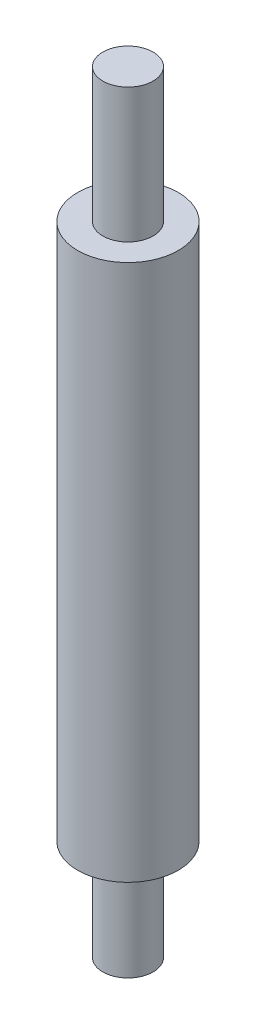
ISO-10303-21;
HEADER;
FILE_DESCRIPTION(('STEP AP214'),'2;1');
FILE_NAME('part.step','',(''),(''),'','','');
FILE_SCHEMA(('AUTOMOTIVE_DESIGN { 1 0 10303 214 1 1 1 1 }'));
ENDSEC;
DATA;
#1=APPLICATION_CONTEXT('core data for automotive mechanical design processes');
#2=APPLICATION_PROTOCOL_DEFINITION('international standard','automotive_design',2000,#1);
#3=PRODUCT_CONTEXT('',#1,'mechanical');
#4=PRODUCT('Part','Part','',(#3));
#5=PRODUCT_RELATED_PRODUCT_CATEGORY('part','',(#4));
#6=PRODUCT_DEFINITION_FORMATION('','',#4);
#7=PRODUCT_DEFINITION_CONTEXT('part definition',#1,'design');
#8=PRODUCT_DEFINITION('design','',#6,#7);
#9=PRODUCT_DEFINITION_SHAPE('','',#8);
#10=(LENGTH_UNIT() NAMED_UNIT(*) SI_UNIT(.MILLI.,.METRE.));
#11=(NAMED_UNIT(*) PLANE_ANGLE_UNIT() SI_UNIT($,.RADIAN.));
#12=(NAMED_UNIT(*) SI_UNIT($,.STERADIAN.) SOLID_ANGLE_UNIT());
#13=UNCERTAINTY_MEASURE_WITH_UNIT(LENGTH_MEASURE(1.E-05),#10,'distance_accuracy_value','');
#14=(GEOMETRIC_REPRESENTATION_CONTEXT(3) GLOBAL_UNCERTAINTY_ASSIGNED_CONTEXT((#13)) GLOBAL_UNIT_ASSIGNED_CONTEXT((#10,
#11,#12)) REPRESENTATION_CONTEXT('',''));
#15=CARTESIAN_POINT('',(0.,0.,0.));
#16=DIRECTION('',(0.,0.,1.));
#17=DIRECTION('',(1.,0.,0.));
#18=AXIS2_PLACEMENT_3D('',#15,#16,#17);
#19=CARTESIAN_POINT('',(0.,38.,0.));
#20=DIRECTION('',(0.,1.,0.));
#21=DIRECTION('',(0.,0.,1.));
#22=AXIS2_PLACEMENT_3D('',#19,#20,#21);
#23=PLANE('',#22);
#24=CARTESIAN_POINT('',(0.,38.,0.));
#25=DIRECTION('',(0.,1.,0.));
#26=DIRECTION('',(0.,0.,1.));
#27=AXIS2_PLACEMENT_3D('',#24,#25,#26);
#28=CIRCLE('',#27,3.);
#29=CARTESIAN_POINT('',(0.,38.,3.));
#30=VERTEX_POINT('',#29);
#31=EDGE_CURVE('E44',#30,#30,#28,.T.);
#32=ORIENTED_EDGE('',*,*,#31,.T.);
#33=EDGE_LOOP('',(#32));
#34=FACE_BOUND('',#33,.T.);
#35=CARTESIAN_POINT('',(0.,38.,0.));
#36=DIRECTION('',(0.,1.,0.));
#37=DIRECTION('',(0.,0.,1.));
#38=AXIS2_PLACEMENT_3D('',#35,#36,#37);
#39=CIRCLE('',#38,1.5);
#40=CARTESIAN_POINT('',(0.,38.,1.5));
#41=VERTEX_POINT('',#40);
#42=EDGE_CURVE('E52',#41,#41,#39,.T.);
#43=ORIENTED_EDGE('',*,*,#42,.F.);
#44=EDGE_LOOP('',(#43));
#45=FACE_BOUND('',#44,.T.);
#46=ADVANCED_FACE('F33',(#34,#45),#23,.T.);
#47=CARTESIAN_POINT('',(0.,6.,0.));
#48=DIRECTION('',(0.,-1.,0.));
#49=DIRECTION('',(0.,0.,-1.));
#50=AXIS2_PLACEMENT_3D('',#47,#48,#49);
#51=CYLINDRICAL_SURFACE('',#50,1.5);
#52=CARTESIAN_POINT('',(0.,6.,0.));
#53=DIRECTION('',(0.,1.,0.));
#54=DIRECTION('',(0.,0.,1.));
#55=AXIS2_PLACEMENT_3D('',#52,#53,#54);
#56=CIRCLE('',#55,1.5);
#57=CARTESIAN_POINT('',(0.,6.,1.5));
#58=VERTEX_POINT('',#57);
#59=EDGE_CURVE('E10',#58,#58,#56,.T.);
#60=ORIENTED_EDGE('',*,*,#59,.F.);
#61=EDGE_LOOP('',(#60));
#62=FACE_BOUND('',#61,.T.);
#63=CARTESIAN_POINT('',(0.,0.,0.));
#64=DIRECTION('',(0.,1.,0.));
#65=DIRECTION('',(0.,0.,1.));
#66=AXIS2_PLACEMENT_3D('',#63,#64,#65);
#67=CIRCLE('',#66,1.5);
#68=CARTESIAN_POINT('',(0.,0.,1.5));
#69=VERTEX_POINT('',#68);
#70=EDGE_CURVE('E37',#69,#69,#67,.T.);
#71=ORIENTED_EDGE('',*,*,#70,.T.);
#72=EDGE_LOOP('',(#71));
#73=FACE_BOUND('',#72,.T.);
#74=ADVANCED_FACE('F35',(#62,#73),#51,.T.);
#75=CARTESIAN_POINT('',(0.,0.,0.));
#76=DIRECTION('',(0.,1.,0.));
#77=DIRECTION('',(0.,0.,1.));
#78=AXIS2_PLACEMENT_3D('',#75,#76,#77);
#79=PLANE('',#78);
#80=ORIENTED_EDGE('',*,*,#70,.F.);
#81=EDGE_LOOP('',(#80));
#82=FACE_BOUND('',#81,.T.);
#83=ADVANCED_FACE('F73',(#82),#79,.F.);
#84=CARTESIAN_POINT('',(0.,6.,0.));
#85=DIRECTION('',(0.,1.,0.));
#86=DIRECTION('',(0.,0.,1.));
#87=AXIS2_PLACEMENT_3D('',#84,#85,#86);
#88=PLANE('',#87);
#89=CARTESIAN_POINT('',(0.,6.,0.));
#90=DIRECTION('',(0.,1.,0.));
#91=DIRECTION('',(0.,0.,1.));
#92=AXIS2_PLACEMENT_3D('',#89,#90,#91);
#93=CIRCLE('',#92,3.);
#94=CARTESIAN_POINT('',(0.,6.,3.));
#95=VERTEX_POINT('',#94);
#96=EDGE_CURVE('E46',#95,#95,#93,.T.);
#97=ORIENTED_EDGE('',*,*,#96,.F.);
#98=EDGE_LOOP('',(#97));
#99=FACE_BOUND('',#98,.T.);
#100=ORIENTED_EDGE('',*,*,#59,.T.);
#101=EDGE_LOOP('',(#100));
#102=FACE_BOUND('',#101,.T.);
#103=ADVANCED_FACE('F77',(#99,#102),#88,.F.);
#104=CARTESIAN_POINT('',(0.,38.,0.));
#105=DIRECTION('',(0.,-1.,0.));
#106=DIRECTION('',(0.,0.,-1.));
#107=AXIS2_PLACEMENT_3D('',#104,#105,#106);
#108=CYLINDRICAL_SURFACE('',#107,3.);
#109=ORIENTED_EDGE('',*,*,#31,.F.);
#110=EDGE_LOOP('',(#109));
#111=FACE_BOUND('',#110,.T.);
#112=ORIENTED_EDGE('',*,*,#96,.T.);
#113=EDGE_LOOP('',(#112));
#114=FACE_BOUND('',#113,.T.);
#115=ADVANCED_FACE('F63',(#111,#114),#108,.T.);
#116=CARTESIAN_POINT('',(0.,46.,0.));
#117=DIRECTION('',(0.,-1.,0.));
#118=DIRECTION('',(0.,0.,-1.));
#119=AXIS2_PLACEMENT_3D('',#116,#117,#118);
#120=CYLINDRICAL_SURFACE('',#119,1.5);
#121=CARTESIAN_POINT('',(0.,46.,0.));
#122=DIRECTION('',(0.,1.,0.));
#123=DIRECTION('',(0.,0.,1.));
#124=AXIS2_PLACEMENT_3D('',#121,#122,#123);
#125=CIRCLE('',#124,1.5);
#126=CARTESIAN_POINT('',(0.,46.,1.5));
#127=VERTEX_POINT('',#126);
#128=EDGE_CURVE('E49',#127,#127,#125,.T.);
#129=ORIENTED_EDGE('',*,*,#128,.F.);
#130=EDGE_LOOP('',(#129));
#131=FACE_BOUND('',#130,.T.);
#132=ORIENTED_EDGE('',*,*,#42,.T.);
#133=EDGE_LOOP('',(#132));
#134=FACE_BOUND('',#133,.T.);
#135=ADVANCED_FACE('F60',(#131,#134),#120,.T.);
#136=CARTESIAN_POINT('',(0.,46.,0.));
#137=DIRECTION('',(0.,1.,0.));
#138=DIRECTION('',(0.,0.,1.));
#139=AXIS2_PLACEMENT_3D('',#136,#137,#138);
#140=PLANE('',#139);
#141=ORIENTED_EDGE('',*,*,#128,.T.);
#142=EDGE_LOOP('',(#141));
#143=FACE_BOUND('',#142,.T.);
#144=ADVANCED_FACE('F58',(#143),#140,.T.);
#145=CLOSED_SHELL('',(#46,#74,#83,#103,#115,#135,#144));
#146=MANIFOLD_SOLID_BREP('B2',#145);
#147=ADVANCED_BREP_SHAPE_REPRESENTATION('',(#18,#146),#14);
#148=SHAPE_DEFINITION_REPRESENTATION(#9,#147);
ENDSEC;
END-ISO-10303-21;
